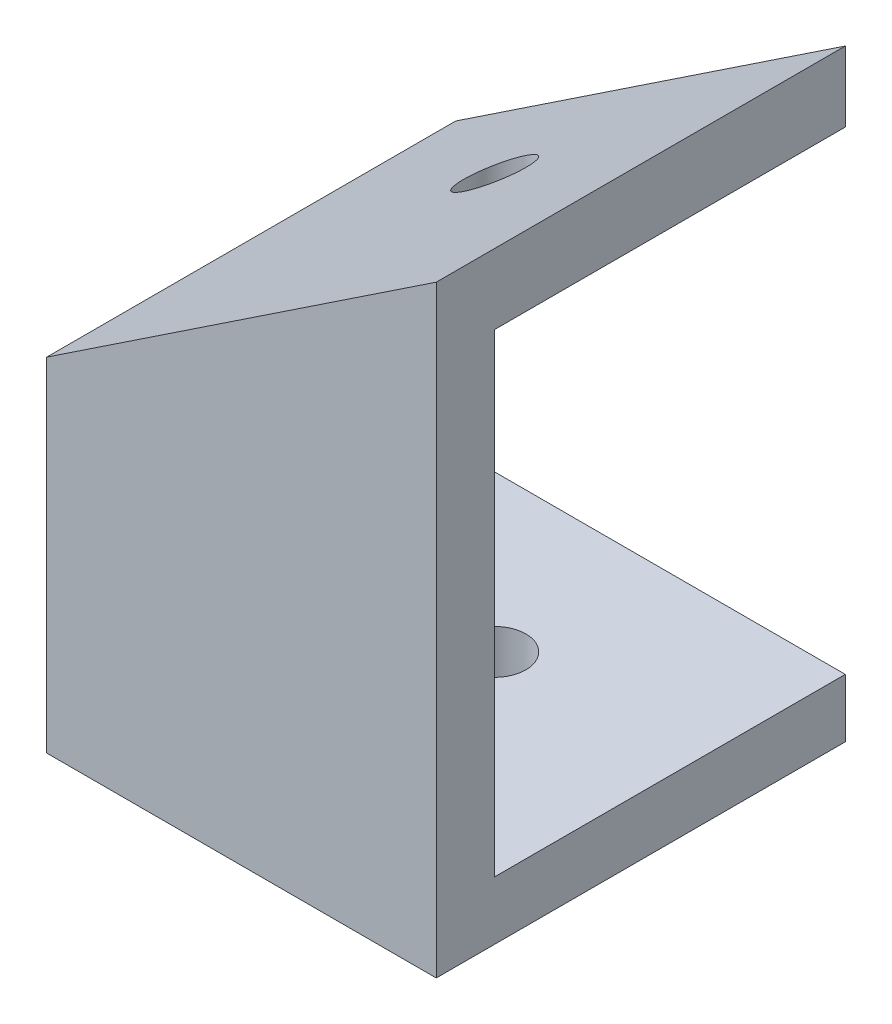
ISO-10303-21;
HEADER;
FILE_DESCRIPTION(('STEP AP214'),'2;1');
FILE_NAME('part.step','',(''),(''),'','','');
FILE_SCHEMA(('AUTOMOTIVE_DESIGN { 1 0 10303 214 1 1 1 1 }'));
ENDSEC;
DATA;
#1=APPLICATION_CONTEXT('core data for automotive mechanical design processes');
#2=APPLICATION_PROTOCOL_DEFINITION('international standard','automotive_design',2000,#1);
#3=PRODUCT_CONTEXT('',#1,'mechanical');
#4=PRODUCT('Part','Part','',(#3));
#5=PRODUCT_RELATED_PRODUCT_CATEGORY('part','',(#4));
#6=PRODUCT_DEFINITION_FORMATION('','',#4);
#7=PRODUCT_DEFINITION_CONTEXT('part definition',#1,'design');
#8=PRODUCT_DEFINITION('design','',#6,#7);
#9=PRODUCT_DEFINITION_SHAPE('','',#8);
#10=(LENGTH_UNIT() NAMED_UNIT(*) SI_UNIT(.MILLI.,.METRE.));
#11=(NAMED_UNIT(*) PLANE_ANGLE_UNIT() SI_UNIT($,.RADIAN.));
#12=(NAMED_UNIT(*) SI_UNIT($,.STERADIAN.) SOLID_ANGLE_UNIT());
#13=UNCERTAINTY_MEASURE_WITH_UNIT(LENGTH_MEASURE(1.E-05),#10,'distance_accuracy_value','');
#14=(GEOMETRIC_REPRESENTATION_CONTEXT(3) GLOBAL_UNCERTAINTY_ASSIGNED_CONTEXT((#13)) GLOBAL_UNIT_ASSIGNED_CONTEXT((#10,
#11,#12)) REPRESENTATION_CONTEXT('',''));
#15=CARTESIAN_POINT('',(0.,0.,0.));
#16=DIRECTION('',(0.,0.,1.));
#17=DIRECTION('',(1.,0.,0.));
#18=AXIS2_PLACEMENT_3D('',#15,#16,#17);
#19=CARTESIAN_POINT('',(-7.63432704055423,8.09385840722787,0.));
#20=DIRECTION('',(0.554700196225229,-0.832050294337844,0.));
#21=DIRECTION('',(0.832050294337844,0.554700196225229,0.));
#22=AXIS2_PLACEMENT_3D('',#19,#20,#21);
#23=PLANE('',#22);
#24=CARTESIAN_POINT('',(2.36567295944577,14.7605250738945,8.));
#25=DIRECTION('',(0.554700196225229,-0.832050294337844,0.));
#26=DIRECTION('',(-0.832050294337844,-0.554700196225229,0.));
#27=AXIS2_PLACEMENT_3D('',#24,#25,#26);
#28=ELLIPSE('',#27,1.92296068024746,1.6);
#29=CARTESIAN_POINT('',(0.765672959445768,13.6938584072279,8.));
#30=VERTEX_POINT('',#29);
#31=EDGE_CURVE('E160',#30,#30,#28,.T.);
#32=ORIENTED_EDGE('',*,*,#31,.F.);
#33=EDGE_LOOP('',(#32));
#34=FACE_BOUND('',#33,.T.);
#35=DIRECTION('',(0.,0.,1.));
#36=VECTOR('',#35,1.);
#37=CARTESIAN_POINT('',(12.3656729594458,21.4271917405612,0.));
#38=LINE('',#37,#36);
#39=CARTESIAN_POINT('',(12.3656729594458,21.4271917405612,0.));
#40=VERTEX_POINT('',#39);
#41=CARTESIAN_POINT('',(12.3656729594457,21.4271917405612,18.));
#42=VERTEX_POINT('',#41);
#43=EDGE_CURVE('E59',#40,#42,#38,.T.);
#44=ORIENTED_EDGE('',*,*,#43,.T.);
#45=DIRECTION('',(-0.832050294337844,-0.554700196225229,0.));
#46=VECTOR('',#45,1.);
#47=CARTESIAN_POINT('',(-7.63432704055423,8.09385840722787,18.));
#48=LINE('',#47,#46);
#49=CARTESIAN_POINT('',(-7.63432704055423,8.09385840722787,18.));
#50=VERTEX_POINT('',#49);
#51=EDGE_CURVE('E140',#42,#50,#48,.T.);
#52=ORIENTED_EDGE('',*,*,#51,.T.);
#53=DIRECTION('',(0.,0.,1.));
#54=VECTOR('',#53,1.);
#55=CARTESIAN_POINT('',(-7.63432704055423,8.09385840722787,0.));
#56=LINE('',#55,#54);
#57=CARTESIAN_POINT('',(-7.63432704055423,8.09385840722787,0.));
#58=VERTEX_POINT('',#57);
#59=EDGE_CURVE('E168',#58,#50,#56,.T.);
#60=ORIENTED_EDGE('',*,*,#59,.F.);
#61=DIRECTION('',(-0.832050294337843,-0.554700196225229,0.));
#62=VECTOR('',#61,1.);
#63=CARTESIAN_POINT('',(12.3656729594458,21.4271917405612,0.));
#64=LINE('',#63,#62);
#65=EDGE_CURVE('E147',#40,#58,#64,.T.);
#66=ORIENTED_EDGE('',*,*,#65,.F.);
#67=EDGE_LOOP('',(#44,#52,#60,#66));
#68=FACE_BOUND('',#67,.T.);
#69=ADVANCED_FACE('F37',(#34,#68),#23,.T.);
#70=CARTESIAN_POINT('',(12.3656729594458,21.4271917405612,3.));
#71=DIRECTION('',(-1.,0.,0.));
#72=DIRECTION('',(0.,-1.,0.));
#73=AXIS2_PLACEMENT_3D('',#70,#71,#72);
#74=PLANE('',#73);
#75=DIRECTION('',(0.,0.,1.));
#76=VECTOR('',#75,1.);
#77=CARTESIAN_POINT('',(12.3656729594458,25.0327430160252,0.));
#78=LINE('',#77,#76);
#79=CARTESIAN_POINT('',(12.3656729594458,25.0327430160252,0.));
#80=VERTEX_POINT('',#79);
#81=CARTESIAN_POINT('',(12.3656729594458,25.0327430160252,21.));
#82=VERTEX_POINT('',#81);
#83=EDGE_CURVE('E148',#80,#82,#78,.T.);
#84=ORIENTED_EDGE('',*,*,#83,.T.);
#85=DIRECTION('',(0.,1.,0.));
#86=VECTOR('',#85,1.);
#87=CARTESIAN_POINT('',(12.3656729594458,21.4271917405612,21.));
#88=LINE('',#87,#86);
#89=CARTESIAN_POINT('',(12.3656729594458,-5.90614159277213,21.));
#90=VERTEX_POINT('',#89);
#91=EDGE_CURVE('E161',#90,#82,#88,.T.);
#92=ORIENTED_EDGE('',*,*,#91,.F.);
#93=DIRECTION('',(0.,0.,1.));
#94=VECTOR('',#93,1.);
#95=CARTESIAN_POINT('',(12.3656729594458,-5.90614159277213,18.));
#96=LINE('',#95,#94);
#97=CARTESIAN_POINT('',(12.3656729594458,-5.90614159277213,0.));
#98=VERTEX_POINT('',#97);
#99=EDGE_CURVE('E137',#98,#90,#96,.T.);
#100=ORIENTED_EDGE('',*,*,#99,.F.);
#101=DIRECTION('',(0.,1.,0.));
#102=VECTOR('',#101,1.);
#103=CARTESIAN_POINT('',(12.3656729594458,21.4271917405612,0.));
#104=LINE('',#103,#102);
#105=CARTESIAN_POINT('',(12.3656729594458,-2.90614159277213,0.));
#106=VERTEX_POINT('',#105);
#107=EDGE_CURVE('E124',#98,#106,#104,.T.);
#108=ORIENTED_EDGE('',*,*,#107,.T.);
#109=DIRECTION('',(0.,0.,1.));
#110=VECTOR('',#109,1.);
#111=CARTESIAN_POINT('',(12.3656729594458,-2.90614159277213,0.));
#112=LINE('',#111,#110);
#113=CARTESIAN_POINT('',(12.3656729594458,-2.90614159277213,18.));
#114=VERTEX_POINT('',#113);
#115=EDGE_CURVE('E52',#106,#114,#112,.T.);
#116=ORIENTED_EDGE('',*,*,#115,.T.);
#117=DIRECTION('',(0.,1.,0.));
#118=VECTOR('',#117,1.);
#119=CARTESIAN_POINT('',(12.3656729594458,-5.90614159277213,18.));
#120=LINE('',#119,#118);
#121=EDGE_CURVE('E134',#114,#42,#120,.T.);
#122=ORIENTED_EDGE('',*,*,#121,.T.);
#123=ORIENTED_EDGE('',*,*,#43,.F.);
#124=DIRECTION('',(0.,1.,0.));
#125=VECTOR('',#124,1.);
#126=CARTESIAN_POINT('',(12.3656729594458,21.4271917405612,0.));
#127=LINE('',#126,#125);
#128=EDGE_CURVE('E144',#40,#80,#127,.T.);
#129=ORIENTED_EDGE('',*,*,#128,.T.);
#130=EDGE_LOOP('',(#84,#92,#100,#108,#116,#122,#123,#129));
#131=FACE_BOUND('',#130,.T.);
#132=ADVANCED_FACE('F39',(#131),#74,.F.);
#133=CARTESIAN_POINT('',(-7.63432704055423,-2.90614159277213,3.));
#134=DIRECTION('',(1.,0.,0.));
#135=DIRECTION('',(0.,0.,-1.));
#136=AXIS2_PLACEMENT_3D('',#133,#134,#135);
#137=PLANE('',#136);
#138=DIRECTION('',(0.,-1.,0.));
#139=VECTOR('',#138,1.);
#140=CARTESIAN_POINT('',(-7.63432704055423,11.6994096826919,18.));
#141=LINE('',#140,#139);
#142=CARTESIAN_POINT('',(-7.63432704055423,-2.90614159277213,18.));
#143=VERTEX_POINT('',#142);
#144=EDGE_CURVE('E109',#50,#143,#141,.T.);
#145=ORIENTED_EDGE('',*,*,#144,.T.);
#146=DIRECTION('',(0.,0.,1.));
#147=VECTOR('',#146,1.);
#148=CARTESIAN_POINT('',(-7.63432704055423,-2.90614159277213,0.));
#149=LINE('',#148,#147);
#150=CARTESIAN_POINT('',(-7.63432704055423,-2.90614159277213,0.));
#151=VERTEX_POINT('',#150);
#152=EDGE_CURVE('E101',#151,#143,#149,.T.);
#153=ORIENTED_EDGE('',*,*,#152,.F.);
#154=DIRECTION('',(0.,-1.,0.));
#155=VECTOR('',#154,1.);
#156=CARTESIAN_POINT('',(-7.63432704055423,-2.90614159277213,0.));
#157=LINE('',#156,#155);
#158=CARTESIAN_POINT('',(-7.63432704055423,-5.90614159277213,0.));
#159=VERTEX_POINT('',#158);
#160=EDGE_CURVE('E106',#151,#159,#157,.T.);
#161=ORIENTED_EDGE('',*,*,#160,.T.);
#162=DIRECTION('',(0.,0.,1.));
#163=VECTOR('',#162,1.);
#164=CARTESIAN_POINT('',(-7.63432704055423,-5.90614159277213,18.));
#165=LINE('',#164,#163);
#166=CARTESIAN_POINT('',(-7.63432704055423,-5.90614159277213,21.));
#167=VERTEX_POINT('',#166);
#168=EDGE_CURVE('E135',#159,#167,#165,.T.);
#169=ORIENTED_EDGE('',*,*,#168,.T.);
#170=DIRECTION('',(0.,-1.,0.));
#171=VECTOR('',#170,1.);
#172=CARTESIAN_POINT('',(-7.63432704055423,8.09385840722787,21.));
#173=LINE('',#172,#171);
#174=CARTESIAN_POINT('',(-7.63432704055423,11.6994096826919,21.));
#175=VERTEX_POINT('',#174);
#176=EDGE_CURVE('E156',#175,#167,#173,.T.);
#177=ORIENTED_EDGE('',*,*,#176,.F.);
#178=DIRECTION('',(0.,0.,1.));
#179=VECTOR('',#178,1.);
#180=CARTESIAN_POINT('',(-7.63432704055423,11.6994096826919,0.));
#181=LINE('',#180,#179);
#182=CARTESIAN_POINT('',(-7.63432704055423,11.6994096826919,0.));
#183=VERTEX_POINT('',#182);
#184=EDGE_CURVE('E146',#183,#175,#181,.T.);
#185=ORIENTED_EDGE('',*,*,#184,.F.);
#186=DIRECTION('',(0.,-1.,0.));
#187=VECTOR('',#186,1.);
#188=CARTESIAN_POINT('',(-7.63432704055423,-2.90614159277213,0.));
#189=LINE('',#188,#187);
#190=EDGE_CURVE('E151',#183,#58,#189,.T.);
#191=ORIENTED_EDGE('',*,*,#190,.T.);
#192=ORIENTED_EDGE('',*,*,#59,.T.);
#193=EDGE_LOOP('',(#145,#153,#161,#169,#177,#185,#191,#192));
#194=FACE_BOUND('',#193,.T.);
#195=ADVANCED_FACE('F103',(#194),#137,.F.);
#196=CARTESIAN_POINT('',(0.,0.,0.));
#197=DIRECTION('',(0.,0.,-1.));
#198=DIRECTION('',(-1.,0.,0.));
#199=AXIS2_PLACEMENT_3D('',#196,#197,#198);
#200=PLANE('',#199);
#201=ORIENTED_EDGE('',*,*,#65,.T.);
#202=ORIENTED_EDGE('',*,*,#190,.F.);
#203=DIRECTION('',(-0.832050294337844,-0.554700196225229,0.));
#204=VECTOR('',#203,1.);
#205=CARTESIAN_POINT('',(-7.63432704055423,11.6994096826919,0.));
#206=LINE('',#205,#204);
#207=EDGE_CURVE('E153',#80,#183,#206,.T.);
#208=ORIENTED_EDGE('',*,*,#207,.F.);
#209=ORIENTED_EDGE('',*,*,#128,.F.);
#210=EDGE_LOOP('',(#201,#202,#208,#209));
#211=FACE_BOUND('',#210,.T.);
#212=ADVANCED_FACE('F181',(#211),#200,.T.);
#213=CARTESIAN_POINT('',(-7.63432704055423,11.6994096826919,0.));
#214=DIRECTION('',(-0.554700196225229,0.832050294337844,0.));
#215=DIRECTION('',(-0.832050294337844,-0.554700196225229,0.));
#216=AXIS2_PLACEMENT_3D('',#213,#214,#215);
#217=PLANE('',#216);
#218=DIRECTION('',(-0.832050294337844,-0.554700196225229,0.));
#219=VECTOR('',#218,1.);
#220=CARTESIAN_POINT('',(-7.63432704055423,11.6994096826919,21.));
#221=LINE('',#220,#219);
#222=EDGE_CURVE('E157',#82,#175,#221,.T.);
#223=ORIENTED_EDGE('',*,*,#222,.F.);
#224=ORIENTED_EDGE('',*,*,#83,.F.);
#225=ORIENTED_EDGE('',*,*,#207,.T.);
#226=ORIENTED_EDGE('',*,*,#184,.T.);
#227=EDGE_LOOP('',(#223,#224,#225,#226));
#228=FACE_BOUND('',#227,.T.);
#229=CARTESIAN_POINT('',(2.36567295944577,18.3660763493585,8.));
#230=DIRECTION('',(-0.554700196225229,0.832050294337844,0.));
#231=DIRECTION('',(-0.832050294337844,-0.554700196225229,0.));
#232=AXIS2_PLACEMENT_3D('',#229,#230,#231);
#233=ELLIPSE('',#232,1.92296068024746,1.6);
#234=CARTESIAN_POINT('',(0.765672959445767,17.2994096826919,8.));
#235=VERTEX_POINT('',#234);
#236=EDGE_CURVE('E45',#235,#235,#233,.T.);
#237=ORIENTED_EDGE('',*,*,#236,.F.);
#238=EDGE_LOOP('',(#237));
#239=FACE_BOUND('',#238,.T.);
#240=ADVANCED_FACE('F179',(#228,#239),#217,.T.);
#241=CARTESIAN_POINT('',(0.,0.,21.));
#242=DIRECTION('',(0.,0.,-1.));
#243=DIRECTION('',(-1.,0.,0.));
#244=AXIS2_PLACEMENT_3D('',#241,#242,#243);
#245=PLANE('',#244);
#246=ORIENTED_EDGE('',*,*,#176,.T.);
#247=DIRECTION('',(1.,0.,0.));
#248=VECTOR('',#247,1.);
#249=CARTESIAN_POINT('',(-7.63432704055423,-5.90614159277213,21.));
#250=LINE('',#249,#248);
#251=EDGE_CURVE('E123',#167,#90,#250,.T.);
#252=ORIENTED_EDGE('',*,*,#251,.T.);
#253=ORIENTED_EDGE('',*,*,#91,.T.);
#254=ORIENTED_EDGE('',*,*,#222,.T.);
#255=EDGE_LOOP('',(#246,#252,#253,#254));
#256=FACE_BOUND('',#255,.T.);
#257=ADVANCED_FACE('F185',(#256),#245,.F.);
#258=CARTESIAN_POINT('',(2.36567295944577,25.0327430160252,8.));
#259=DIRECTION('',(0.,-1.,0.));
#260=DIRECTION('',(1.,0.,0.));
#261=AXIS2_PLACEMENT_3D('',#258,#259,#260);
#262=CYLINDRICAL_SURFACE('',#261,1.6);
#263=ORIENTED_EDGE('',*,*,#31,.T.);
#264=EDGE_LOOP('',(#263));
#265=FACE_BOUND('',#264,.T.);
#266=ORIENTED_EDGE('',*,*,#236,.T.);
#267=EDGE_LOOP('',(#266));
#268=FACE_BOUND('',#267,.T.);
#269=ADVANCED_FACE('F198',(#265,#268),#262,.F.);
#270=CARTESIAN_POINT('',(-7.63432704055423,-5.90614159277213,18.));
#271=DIRECTION('',(0.,-1.,0.));
#272=DIRECTION('',(1.,0.,0.));
#273=AXIS2_PLACEMENT_3D('',#270,#271,#272);
#274=PLANE('',#273);
#275=ORIENTED_EDGE('',*,*,#251,.F.);
#276=ORIENTED_EDGE('',*,*,#168,.F.);
#277=DIRECTION('',(1.,0.,0.));
#278=VECTOR('',#277,1.);
#279=CARTESIAN_POINT('',(12.3656729594458,-5.90614159277213,0.));
#280=LINE('',#279,#278);
#281=EDGE_CURVE('E122',#159,#98,#280,.T.);
#282=ORIENTED_EDGE('',*,*,#281,.T.);
#283=ORIENTED_EDGE('',*,*,#99,.T.);
#284=EDGE_LOOP('',(#275,#276,#282,#283));
#285=FACE_BOUND('',#284,.T.);
#286=CARTESIAN_POINT('',(2.36567295944577,-5.90614159277213,8.));
#287=DIRECTION('',(0.,-1.,0.));
#288=DIRECTION('',(1.,0.,0.));
#289=AXIS2_PLACEMENT_3D('',#286,#287,#288);
#290=CIRCLE('',#289,1.6);
#291=CARTESIAN_POINT('',(3.96567295944577,-5.90614159277213,8.));
#292=VERTEX_POINT('',#291);
#293=EDGE_CURVE('E118',#292,#292,#290,.T.);
#294=ORIENTED_EDGE('',*,*,#293,.F.);
#295=EDGE_LOOP('',(#294));
#296=FACE_BOUND('',#295,.T.);
#297=ADVANCED_FACE('F188',(#285,#296),#274,.T.);
#298=CARTESIAN_POINT('',(0.,0.,18.));
#299=DIRECTION('',(0.,0.,1.));
#300=DIRECTION('',(1.,0.,0.));
#301=AXIS2_PLACEMENT_3D('',#298,#299,#300);
#302=PLANE('',#301);
#303=ORIENTED_EDGE('',*,*,#121,.F.);
#304=DIRECTION('',(-1.,0.,0.));
#305=VECTOR('',#304,1.);
#306=CARTESIAN_POINT('',(0.,-2.90614159277213,18.));
#307=LINE('',#306,#305);
#308=EDGE_CURVE('E11',#114,#143,#307,.T.);
#309=ORIENTED_EDGE('',*,*,#308,.T.);
#310=ORIENTED_EDGE('',*,*,#144,.F.);
#311=ORIENTED_EDGE('',*,*,#51,.F.);
#312=EDGE_LOOP('',(#303,#309,#310,#311));
#313=FACE_BOUND('',#312,.T.);
#314=ADVANCED_FACE('F197',(#313),#302,.F.);
#315=CARTESIAN_POINT('',(-7.63432704055423,-2.90614159277213,0.));
#316=DIRECTION('',(0.,1.,0.));
#317=DIRECTION('',(0.,0.,1.));
#318=AXIS2_PLACEMENT_3D('',#315,#316,#317);
#319=PLANE('',#318);
#320=CARTESIAN_POINT('',(2.36567295944577,-2.90614159277213,8.));
#321=DIRECTION('',(0.,1.,0.));
#322=DIRECTION('',(0.,0.,1.));
#323=AXIS2_PLACEMENT_3D('',#320,#321,#322);
#324=CIRCLE('',#323,1.6);
#325=CARTESIAN_POINT('',(2.36567295944577,-2.90614159277213,9.6));
#326=VERTEX_POINT('',#325);
#327=EDGE_CURVE('E111',#326,#326,#324,.T.);
#328=ORIENTED_EDGE('',*,*,#327,.F.);
#329=EDGE_LOOP('',(#328));
#330=FACE_BOUND('',#329,.T.);
#331=ORIENTED_EDGE('',*,*,#308,.F.);
#332=ORIENTED_EDGE('',*,*,#115,.F.);
#333=DIRECTION('',(1.,0.,0.));
#334=VECTOR('',#333,1.);
#335=CARTESIAN_POINT('',(-7.63432704055423,-2.90614159277213,0.));
#336=LINE('',#335,#334);
#337=EDGE_CURVE('E114',#151,#106,#336,.T.);
#338=ORIENTED_EDGE('',*,*,#337,.F.);
#339=ORIENTED_EDGE('',*,*,#152,.T.);
#340=EDGE_LOOP('',(#331,#332,#338,#339));
#341=FACE_BOUND('',#340,.T.);
#342=ADVANCED_FACE('F115',(#330,#341),#319,.T.);
#343=CARTESIAN_POINT('',(2.36567295944577,25.0327430160252,8.));
#344=DIRECTION('',(0.,-1.,0.));
#345=DIRECTION('',(1.,0.,0.));
#346=AXIS2_PLACEMENT_3D('',#343,#344,#345);
#347=CYLINDRICAL_SURFACE('',#346,1.6);
#348=ORIENTED_EDGE('',*,*,#327,.T.);
#349=EDGE_LOOP('',(#348));
#350=FACE_BOUND('',#349,.T.);
#351=ORIENTED_EDGE('',*,*,#293,.T.);
#352=EDGE_LOOP('',(#351));
#353=FACE_BOUND('',#352,.T.);
#354=ADVANCED_FACE('F195',(#350,#353),#347,.F.);
#355=CARTESIAN_POINT('',(0.,0.,0.));
#356=DIRECTION('',(0.,0.,-1.));
#357=DIRECTION('',(-1.,0.,0.));
#358=AXIS2_PLACEMENT_3D('',#355,#356,#357);
#359=PLANE('',#358);
#360=ORIENTED_EDGE('',*,*,#337,.T.);
#361=ORIENTED_EDGE('',*,*,#107,.F.);
#362=ORIENTED_EDGE('',*,*,#281,.F.);
#363=ORIENTED_EDGE('',*,*,#160,.F.);
#364=EDGE_LOOP('',(#360,#361,#362,#363));
#365=FACE_BOUND('',#364,.T.);
#366=ADVANCED_FACE('F120',(#365),#359,.T.);
#367=CLOSED_SHELL('',(#69,#132,#195,#212,#240,#257,#269,#297,#314,#342,#354,#366));
#368=MANIFOLD_SOLID_BREP('B2',#367);
#369=ADVANCED_BREP_SHAPE_REPRESENTATION('',(#18,#368),#14);
#370=SHAPE_DEFINITION_REPRESENTATION(#9,#369);
ENDSEC;
END-ISO-10303-21;
